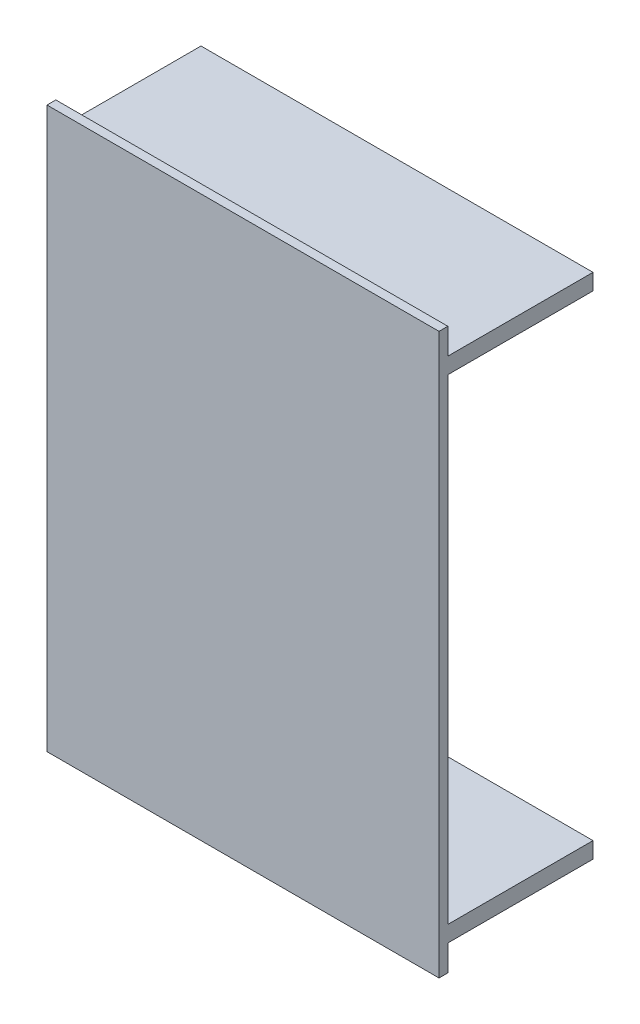
ISO-10303-21;
HEADER;
FILE_DESCRIPTION(('STEP AP214'),'2;1');
FILE_NAME('part.step','',(''),(''),'','','');
FILE_SCHEMA(('AUTOMOTIVE_DESIGN { 1 0 10303 214 1 1 1 1 }'));
ENDSEC;
DATA;
#1=APPLICATION_CONTEXT('core data for automotive mechanical design processes');
#2=APPLICATION_PROTOCOL_DEFINITION('international standard','automotive_design',2000,#1);
#3=PRODUCT_CONTEXT('',#1,'mechanical');
#4=PRODUCT('Part','Part','',(#3));
#5=PRODUCT_RELATED_PRODUCT_CATEGORY('part','',(#4));
#6=PRODUCT_DEFINITION_FORMATION('','',#4);
#7=PRODUCT_DEFINITION_CONTEXT('part definition',#1,'design');
#8=PRODUCT_DEFINITION('design','',#6,#7);
#9=PRODUCT_DEFINITION_SHAPE('','',#8);
#10=(LENGTH_UNIT() NAMED_UNIT(*) SI_UNIT(.MILLI.,.METRE.));
#11=(NAMED_UNIT(*) PLANE_ANGLE_UNIT() SI_UNIT($,.RADIAN.));
#12=(NAMED_UNIT(*) SI_UNIT($,.STERADIAN.) SOLID_ANGLE_UNIT());
#13=UNCERTAINTY_MEASURE_WITH_UNIT(LENGTH_MEASURE(1.E-05),#10,'distance_accuracy_value','');
#14=(GEOMETRIC_REPRESENTATION_CONTEXT(3) GLOBAL_UNCERTAINTY_ASSIGNED_CONTEXT((#13)) GLOBAL_UNIT_ASSIGNED_CONTEXT((#10,
#11,#12)) REPRESENTATION_CONTEXT('',''));
#15=CARTESIAN_POINT('',(0.,0.,0.));
#16=DIRECTION('',(0.,0.,1.));
#17=DIRECTION('',(1.,0.,0.));
#18=AXIS2_PLACEMENT_3D('',#15,#16,#17);
#19=CARTESIAN_POINT('',(0.,0.,0.));
#20=DIRECTION('',(0.,0.,-1.));
#21=DIRECTION('',(-1.,0.,0.));
#22=AXIS2_PLACEMENT_3D('',#19,#20,#21);
#23=PLANE('',#22);
#24=DIRECTION('',(0.,1.,0.));
#25=VECTOR('',#24,1.);
#26=CARTESIAN_POINT('',(280.,0.,0.));
#27=LINE('',#26,#25);
#28=CARTESIAN_POINT('',(280.,381.5,0.));
#29=VERTEX_POINT('',#28);
#30=CARTESIAN_POINT('',(280.,400.,0.));
#31=VERTEX_POINT('',#30);
#32=EDGE_CURVE('E201',#29,#31,#27,.T.);
#33=ORIENTED_EDGE('',*,*,#32,.F.);
#34=DIRECTION('',(-1.,0.,0.));
#35=VECTOR('',#34,1.);
#36=CARTESIAN_POINT('',(384.335708173185,381.5,0.));
#37=LINE('',#36,#35);
#38=CARTESIAN_POINT('',(0.,381.5,0.));
#39=VERTEX_POINT('',#38);
#40=EDGE_CURVE('E55',#29,#39,#37,.T.);
#41=ORIENTED_EDGE('',*,*,#40,.T.);
#42=DIRECTION('',(0.,-1.,0.));
#43=VECTOR('',#42,1.);
#44=CARTESIAN_POINT('',(0.,0.,0.));
#45=LINE('',#44,#43);
#46=CARTESIAN_POINT('',(0.,400.,0.));
#47=VERTEX_POINT('',#46);
#48=EDGE_CURVE('E196',#47,#39,#45,.T.);
#49=ORIENTED_EDGE('',*,*,#48,.F.);
#50=DIRECTION('',(-1.,0.,0.));
#51=VECTOR('',#50,1.);
#52=CARTESIAN_POINT('',(0.,400.,0.));
#53=LINE('',#52,#51);
#54=EDGE_CURVE('E189',#31,#47,#53,.T.);
#55=ORIENTED_EDGE('',*,*,#54,.F.);
#56=EDGE_LOOP('',(#33,#41,#49,#55));
#57=FACE_BOUND('',#56,.T.);
#58=ADVANCED_FACE('F40',(#57),#23,.T.);
#59=CARTESIAN_POINT('',(0.,370.,0.));
#60=VERTEX_POINT('',#59);
#61=CARTESIAN_POINT('',(0.,30.,0.));
#62=VERTEX_POINT('',#61);
#63=EDGE_CURVE('E63',#60,#62,#45,.T.);
#64=ORIENTED_EDGE('',*,*,#63,.F.);
#65=DIRECTION('',(-1.,0.,0.));
#66=VECTOR('',#65,1.);
#67=CARTESIAN_POINT('',(384.335708173185,370.,0.));
#68=LINE('',#67,#66);
#69=CARTESIAN_POINT('',(280.,370.,0.));
#70=VERTEX_POINT('',#69);
#71=EDGE_CURVE('E151',#70,#60,#68,.T.);
#72=ORIENTED_EDGE('',*,*,#71,.F.);
#73=CARTESIAN_POINT('',(280.,30.,0.));
#74=VERTEX_POINT('',#73);
#75=EDGE_CURVE('E139',#74,#70,#27,.T.);
#76=ORIENTED_EDGE('',*,*,#75,.F.);
#77=DIRECTION('',(-1.,0.,0.));
#78=VECTOR('',#77,1.);
#79=CARTESIAN_POINT('',(384.335708173185,30.,0.));
#80=LINE('',#79,#78);
#81=EDGE_CURVE('E174',#74,#62,#80,.T.);
#82=ORIENTED_EDGE('',*,*,#81,.T.);
#83=EDGE_LOOP('',(#64,#72,#76,#82));
#84=FACE_BOUND('',#83,.T.);
#85=ADVANCED_FACE('F233',(#84),#23,.T.);
#86=CARTESIAN_POINT('',(0.,0.,6.3));
#87=DIRECTION('',(1.,0.,0.));
#88=DIRECTION('',(0.,0.,-1.));
#89=AXIS2_PLACEMENT_3D('',#86,#87,#88);
#90=PLANE('',#89);
#91=ORIENTED_EDGE('',*,*,#48,.T.);
#92=DIRECTION('',(0.,0.,1.));
#93=VECTOR('',#92,1.);
#94=CARTESIAN_POINT('',(0.,381.5,0.));
#95=LINE('',#94,#93);
#96=CARTESIAN_POINT('',(0.,381.5,-103.7));
#97=VERTEX_POINT('',#96);
#98=EDGE_CURVE('E243',#97,#39,#95,.T.);
#99=ORIENTED_EDGE('',*,*,#98,.F.);
#100=DIRECTION('',(0.,1.,0.));
#101=VECTOR('',#100,1.);
#102=CARTESIAN_POINT('',(0.,381.5,-103.7));
#103=LINE('',#102,#101);
#104=CARTESIAN_POINT('',(0.,370.,-103.7));
#105=VERTEX_POINT('',#104);
#106=EDGE_CURVE('E369',#105,#97,#103,.T.);
#107=ORIENTED_EDGE('',*,*,#106,.F.);
#108=DIRECTION('',(0.,0.,-1.));
#109=VECTOR('',#108,1.);
#110=CARTESIAN_POINT('',(0.,370.,0.));
#111=LINE('',#110,#109);
#112=EDGE_CURVE('E146',#60,#105,#111,.T.);
#113=ORIENTED_EDGE('',*,*,#112,.F.);
#114=ORIENTED_EDGE('',*,*,#63,.T.);
#115=DIRECTION('',(0.,0.,1.));
#116=VECTOR('',#115,1.);
#117=CARTESIAN_POINT('',(0.,30.,0.));
#118=LINE('',#117,#116);
#119=CARTESIAN_POINT('',(0.,30.,-103.7));
#120=VERTEX_POINT('',#119);
#121=EDGE_CURVE('E172',#120,#62,#118,.T.);
#122=ORIENTED_EDGE('',*,*,#121,.F.);
#123=DIRECTION('',(0.,1.,0.));
#124=VECTOR('',#123,1.);
#125=CARTESIAN_POINT('',(0.,18.5,-103.7));
#126=LINE('',#125,#124);
#127=CARTESIAN_POINT('',(0.,18.5,-103.7));
#128=VERTEX_POINT('',#127);
#129=EDGE_CURVE('E169',#128,#120,#126,.T.);
#130=ORIENTED_EDGE('',*,*,#129,.F.);
#131=DIRECTION('',(0.,0.,-1.));
#132=VECTOR('',#131,1.);
#133=CARTESIAN_POINT('',(0.,18.5,0.));
#134=LINE('',#133,#132);
#135=CARTESIAN_POINT('',(0.,18.5,0.));
#136=VERTEX_POINT('',#135);
#137=EDGE_CURVE('E166',#136,#128,#134,.T.);
#138=ORIENTED_EDGE('',*,*,#137,.F.);
#139=CARTESIAN_POINT('',(0.,0.,0.));
#140=VERTEX_POINT('',#139);
#141=EDGE_CURVE('E165',#136,#140,#45,.T.);
#142=ORIENTED_EDGE('',*,*,#141,.T.);
#143=DIRECTION('',(0.,0.,-1.));
#144=VECTOR('',#143,1.);
#145=CARTESIAN_POINT('',(0.,0.,6.3));
#146=LINE('',#145,#144);
#147=CARTESIAN_POINT('',(0.,0.,6.3));
#148=VERTEX_POINT('',#147);
#149=EDGE_CURVE('E11',#148,#140,#146,.T.);
#150=ORIENTED_EDGE('',*,*,#149,.F.);
#151=DIRECTION('',(0.,-1.,0.));
#152=VECTOR('',#151,1.);
#153=CARTESIAN_POINT('',(0.,0.,6.3));
#154=LINE('',#153,#152);
#155=CARTESIAN_POINT('',(0.,400.,6.3));
#156=VERTEX_POINT('',#155);
#157=EDGE_CURVE('E185',#156,#148,#154,.T.);
#158=ORIENTED_EDGE('',*,*,#157,.F.);
#159=DIRECTION('',(0.,0.,-1.));
#160=VECTOR('',#159,1.);
#161=CARTESIAN_POINT('',(0.,400.,6.3));
#162=LINE('',#161,#160);
#163=EDGE_CURVE('E195',#156,#47,#162,.T.);
#164=ORIENTED_EDGE('',*,*,#163,.T.);
#165=EDGE_LOOP('',(#91,#99,#107,#113,#114,#122,#130,#138,#142,#150,#158,#164));
#166=FACE_BOUND('',#165,.T.);
#167=ADVANCED_FACE('F42',(#166),#90,.F.);
#168=CARTESIAN_POINT('',(0.,0.,6.3));
#169=DIRECTION('',(0.,1.,0.));
#170=DIRECTION('',(0.,0.,1.));
#171=AXIS2_PLACEMENT_3D('',#168,#169,#170);
#172=PLANE('',#171);
#173=DIRECTION('',(1.,0.,0.));
#174=VECTOR('',#173,1.);
#175=CARTESIAN_POINT('',(0.,0.,0.));
#176=LINE('',#175,#174);
#177=CARTESIAN_POINT('',(280.,0.,0.));
#178=VERTEX_POINT('',#177);
#179=EDGE_CURVE('E199',#140,#178,#176,.T.);
#180=ORIENTED_EDGE('',*,*,#179,.T.);
#181=DIRECTION('',(0.,0.,-1.));
#182=VECTOR('',#181,1.);
#183=CARTESIAN_POINT('',(280.,0.,6.3));
#184=LINE('',#183,#182);
#185=CARTESIAN_POINT('',(280.,0.,6.3));
#186=VERTEX_POINT('',#185);
#187=EDGE_CURVE('E48',#186,#178,#184,.T.);
#188=ORIENTED_EDGE('',*,*,#187,.F.);
#189=DIRECTION('',(1.,0.,0.));
#190=VECTOR('',#189,1.);
#191=CARTESIAN_POINT('',(0.,0.,6.3));
#192=LINE('',#191,#190);
#193=EDGE_CURVE('E188',#148,#186,#192,.T.);
#194=ORIENTED_EDGE('',*,*,#193,.F.);
#195=ORIENTED_EDGE('',*,*,#149,.T.);
#196=EDGE_LOOP('',(#180,#188,#194,#195));
#197=FACE_BOUND('',#196,.T.);
#198=ADVANCED_FACE('F247',(#197),#172,.F.);
#199=CARTESIAN_POINT('',(280.,0.,6.3));
#200=DIRECTION('',(-1.,0.,0.));
#201=DIRECTION('',(0.,0.,1.));
#202=AXIS2_PLACEMENT_3D('',#199,#200,#201);
#203=PLANE('',#202);
#204=CARTESIAN_POINT('',(280.,18.5,0.));
#205=VERTEX_POINT('',#204);
#206=EDGE_CURVE('E202',#178,#205,#27,.T.);
#207=ORIENTED_EDGE('',*,*,#206,.T.);
#208=DIRECTION('',(0.,0.,1.));
#209=VECTOR('',#208,1.);
#210=CARTESIAN_POINT('',(280.,18.5,0.));
#211=LINE('',#210,#209);
#212=CARTESIAN_POINT('',(280.,18.5,-103.7));
#213=VERTEX_POINT('',#212);
#214=EDGE_CURVE('E162',#213,#205,#211,.T.);
#215=ORIENTED_EDGE('',*,*,#214,.F.);
#216=DIRECTION('',(0.,-1.,0.));
#217=VECTOR('',#216,1.);
#218=CARTESIAN_POINT('',(280.,18.5,-103.7));
#219=LINE('',#218,#217);
#220=CARTESIAN_POINT('',(280.,30.,-103.7));
#221=VERTEX_POINT('',#220);
#222=EDGE_CURVE('E159',#221,#213,#219,.T.);
#223=ORIENTED_EDGE('',*,*,#222,.F.);
#224=DIRECTION('',(0.,0.,-1.));
#225=VECTOR('',#224,1.);
#226=CARTESIAN_POINT('',(280.,30.,0.));
#227=LINE('',#226,#225);
#228=EDGE_CURVE('E163',#74,#221,#227,.T.);
#229=ORIENTED_EDGE('',*,*,#228,.F.);
#230=ORIENTED_EDGE('',*,*,#75,.T.);
#231=DIRECTION('',(0.,0.,1.));
#232=VECTOR('',#231,1.);
#233=CARTESIAN_POINT('',(280.,370.,0.));
#234=LINE('',#233,#232);
#235=CARTESIAN_POINT('',(280.,370.,-103.7));
#236=VERTEX_POINT('',#235);
#237=EDGE_CURVE('E131',#236,#70,#234,.T.);
#238=ORIENTED_EDGE('',*,*,#237,.F.);
#239=DIRECTION('',(0.,-1.,0.));
#240=VECTOR('',#239,1.);
#241=CARTESIAN_POINT('',(280.,381.5,-103.7));
#242=LINE('',#241,#240);
#243=CARTESIAN_POINT('',(280.,381.5,-103.7));
#244=VERTEX_POINT('',#243);
#245=EDGE_CURVE('E136',#244,#236,#242,.T.);
#246=ORIENTED_EDGE('',*,*,#245,.F.);
#247=DIRECTION('',(0.,0.,-1.));
#248=VECTOR('',#247,1.);
#249=CARTESIAN_POINT('',(280.,381.5,0.));
#250=LINE('',#249,#248);
#251=EDGE_CURVE('E154',#29,#244,#250,.T.);
#252=ORIENTED_EDGE('',*,*,#251,.F.);
#253=ORIENTED_EDGE('',*,*,#32,.T.);
#254=DIRECTION('',(0.,0.,-1.));
#255=VECTOR('',#254,1.);
#256=CARTESIAN_POINT('',(280.,400.,6.3));
#257=LINE('',#256,#255);
#258=CARTESIAN_POINT('',(280.,400.,6.3));
#259=VERTEX_POINT('',#258);
#260=EDGE_CURVE('E207',#259,#31,#257,.T.);
#261=ORIENTED_EDGE('',*,*,#260,.F.);
#262=DIRECTION('',(0.,1.,0.));
#263=VECTOR('',#262,1.);
#264=CARTESIAN_POINT('',(280.,0.,6.3));
#265=LINE('',#264,#263);
#266=EDGE_CURVE('E191',#186,#259,#265,.T.);
#267=ORIENTED_EDGE('',*,*,#266,.F.);
#268=ORIENTED_EDGE('',*,*,#187,.T.);
#269=EDGE_LOOP('',(#207,#215,#223,#229,#230,#238,#246,#252,#253,#261,#267,#268));
#270=FACE_BOUND('',#269,.T.);
#271=ADVANCED_FACE('F134',(#270),#203,.F.);
#272=CARTESIAN_POINT('',(0.,400.,6.3));
#273=DIRECTION('',(0.,-1.,0.));
#274=DIRECTION('',(0.,0.,-1.));
#275=AXIS2_PLACEMENT_3D('',#272,#273,#274);
#276=PLANE('',#275);
#277=ORIENTED_EDGE('',*,*,#54,.T.);
#278=ORIENTED_EDGE('',*,*,#163,.F.);
#279=DIRECTION('',(-1.,0.,0.));
#280=VECTOR('',#279,1.);
#281=CARTESIAN_POINT('',(0.,400.,6.3));
#282=LINE('',#281,#280);
#283=EDGE_CURVE('E193',#259,#156,#282,.T.);
#284=ORIENTED_EDGE('',*,*,#283,.F.);
#285=ORIENTED_EDGE('',*,*,#260,.T.);
#286=EDGE_LOOP('',(#277,#278,#284,#285));
#287=FACE_BOUND('',#286,.T.);
#288=ADVANCED_FACE('F239',(#287),#276,.F.);
#289=CARTESIAN_POINT('',(0.,0.,6.3));
#290=DIRECTION('',(0.,0.,-1.));
#291=DIRECTION('',(-1.,0.,0.));
#292=AXIS2_PLACEMENT_3D('',#289,#290,#291);
#293=PLANE('',#292);
#294=ORIENTED_EDGE('',*,*,#157,.T.);
#295=ORIENTED_EDGE('',*,*,#193,.T.);
#296=ORIENTED_EDGE('',*,*,#266,.T.);
#297=ORIENTED_EDGE('',*,*,#283,.T.);
#298=EDGE_LOOP('',(#294,#295,#296,#297));
#299=FACE_BOUND('',#298,.T.);
#300=ADVANCED_FACE('F246',(#299),#293,.F.);
#301=DIRECTION('',(-1.,0.,0.));
#302=VECTOR('',#301,1.);
#303=CARTESIAN_POINT('',(384.335708173185,18.5,0.));
#304=LINE('',#303,#302);
#305=EDGE_CURVE('E181',#205,#136,#304,.T.);
#306=ORIENTED_EDGE('',*,*,#305,.F.);
#307=ORIENTED_EDGE('',*,*,#206,.F.);
#308=ORIENTED_EDGE('',*,*,#179,.F.);
#309=ORIENTED_EDGE('',*,*,#141,.F.);
#310=EDGE_LOOP('',(#306,#307,#308,#309));
#311=FACE_BOUND('',#310,.T.);
#312=ADVANCED_FACE('F218',(#311),#23,.T.);
#313=CARTESIAN_POINT('',(384.335708173185,30.,0.));
#314=DIRECTION('',(0.,-1.,0.));
#315=DIRECTION('',(0.,0.,-1.));
#316=AXIS2_PLACEMENT_3D('',#313,#314,#315);
#317=PLANE('',#316);
#318=ORIENTED_EDGE('',*,*,#81,.F.);
#319=ORIENTED_EDGE('',*,*,#228,.T.);
#320=DIRECTION('',(-1.,0.,0.));
#321=VECTOR('',#320,1.);
#322=CARTESIAN_POINT('',(384.335708173185,30.,-103.7));
#323=LINE('',#322,#321);
#324=EDGE_CURVE('E177',#221,#120,#323,.T.);
#325=ORIENTED_EDGE('',*,*,#324,.T.);
#326=ORIENTED_EDGE('',*,*,#121,.T.);
#327=EDGE_LOOP('',(#318,#319,#325,#326));
#328=FACE_BOUND('',#327,.T.);
#329=ADVANCED_FACE('F231',(#328),#317,.F.);
#330=CARTESIAN_POINT('',(384.335708173185,18.5,-103.7));
#331=DIRECTION('',(0.,0.,1.));
#332=DIRECTION('',(1.,0.,0.));
#333=AXIS2_PLACEMENT_3D('',#330,#331,#332);
#334=PLANE('',#333);
#335=ORIENTED_EDGE('',*,*,#324,.F.);
#336=ORIENTED_EDGE('',*,*,#222,.T.);
#337=DIRECTION('',(-1.,0.,0.));
#338=VECTOR('',#337,1.);
#339=CARTESIAN_POINT('',(384.335708173185,18.5,-103.7));
#340=LINE('',#339,#338);
#341=EDGE_CURVE('E179',#213,#128,#340,.T.);
#342=ORIENTED_EDGE('',*,*,#341,.T.);
#343=ORIENTED_EDGE('',*,*,#129,.T.);
#344=EDGE_LOOP('',(#335,#336,#342,#343));
#345=FACE_BOUND('',#344,.T.);
#346=ADVANCED_FACE('F228',(#345),#334,.F.);
#347=CARTESIAN_POINT('',(384.335708173185,18.5,0.));
#348=DIRECTION('',(0.,1.,0.));
#349=DIRECTION('',(0.,0.,1.));
#350=AXIS2_PLACEMENT_3D('',#347,#348,#349);
#351=PLANE('',#350);
#352=ORIENTED_EDGE('',*,*,#341,.F.);
#353=ORIENTED_EDGE('',*,*,#214,.T.);
#354=ORIENTED_EDGE('',*,*,#305,.T.);
#355=ORIENTED_EDGE('',*,*,#137,.T.);
#356=EDGE_LOOP('',(#352,#353,#354,#355));
#357=FACE_BOUND('',#356,.T.);
#358=ADVANCED_FACE('F223',(#357),#351,.F.);
#359=CARTESIAN_POINT('',(384.335708173185,381.5,0.));
#360=DIRECTION('',(0.,-1.,0.));
#361=DIRECTION('',(0.,0.,-1.));
#362=AXIS2_PLACEMENT_3D('',#359,#360,#361);
#363=PLANE('',#362);
#364=ORIENTED_EDGE('',*,*,#40,.F.);
#365=ORIENTED_EDGE('',*,*,#251,.T.);
#366=DIRECTION('',(-1.,0.,0.));
#367=VECTOR('',#366,1.);
#368=CARTESIAN_POINT('',(384.335708173185,381.5,-103.7));
#369=LINE('',#368,#367);
#370=EDGE_CURVE('E150',#244,#97,#369,.T.);
#371=ORIENTED_EDGE('',*,*,#370,.T.);
#372=ORIENTED_EDGE('',*,*,#98,.T.);
#373=EDGE_LOOP('',(#364,#365,#371,#372));
#374=FACE_BOUND('',#373,.T.);
#375=ADVANCED_FACE('F273',(#374),#363,.F.);
#376=CARTESIAN_POINT('',(384.335708173185,381.5,-103.7));
#377=DIRECTION('',(0.,0.,1.));
#378=DIRECTION('',(1.,0.,0.));
#379=AXIS2_PLACEMENT_3D('',#376,#377,#378);
#380=PLANE('',#379);
#381=ORIENTED_EDGE('',*,*,#370,.F.);
#382=ORIENTED_EDGE('',*,*,#245,.T.);
#383=DIRECTION('',(-1.,0.,0.));
#384=VECTOR('',#383,1.);
#385=CARTESIAN_POINT('',(384.335708173185,370.,-103.7));
#386=LINE('',#385,#384);
#387=EDGE_CURVE('E144',#236,#105,#386,.T.);
#388=ORIENTED_EDGE('',*,*,#387,.T.);
#389=ORIENTED_EDGE('',*,*,#106,.T.);
#390=EDGE_LOOP('',(#381,#382,#388,#389));
#391=FACE_BOUND('',#390,.T.);
#392=ADVANCED_FACE('F153',(#391),#380,.F.);
#393=CARTESIAN_POINT('',(384.335708173185,370.,0.));
#394=DIRECTION('',(0.,1.,0.));
#395=DIRECTION('',(0.,0.,1.));
#396=AXIS2_PLACEMENT_3D('',#393,#394,#395);
#397=PLANE('',#396);
#398=ORIENTED_EDGE('',*,*,#387,.F.);
#399=ORIENTED_EDGE('',*,*,#237,.T.);
#400=ORIENTED_EDGE('',*,*,#71,.T.);
#401=ORIENTED_EDGE('',*,*,#112,.T.);
#402=EDGE_LOOP('',(#398,#399,#400,#401));
#403=FACE_BOUND('',#402,.T.);
#404=ADVANCED_FACE('F145',(#403),#397,.F.);
#405=CLOSED_SHELL('',(#58,#85,#167,#198,#271,#288,#300,#312,#329,#346,#358,#375,#392,#404));
#406=MANIFOLD_SOLID_BREP('B2',#405);
#407=ADVANCED_BREP_SHAPE_REPRESENTATION('',(#18,#406),#14);
#408=SHAPE_DEFINITION_REPRESENTATION(#9,#407);
ENDSEC;
END-ISO-10303-21;
